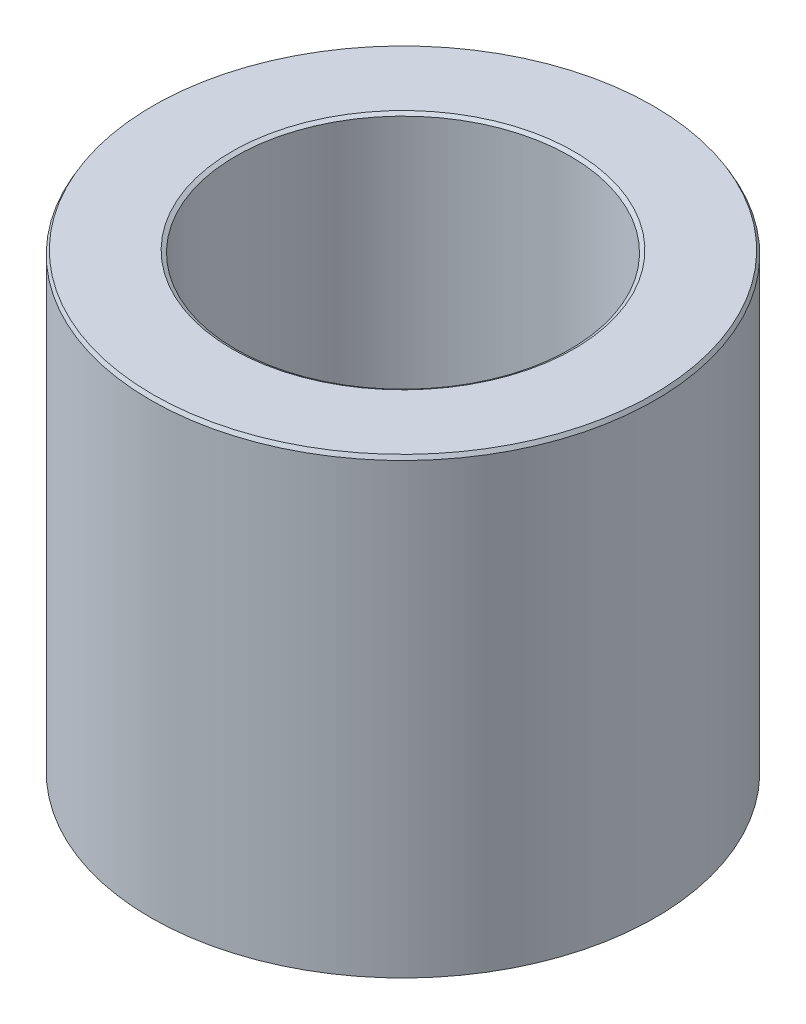
ISO-10303-21;
HEADER;
FILE_DESCRIPTION(('STEP AP214'),'2;1');
FILE_NAME('part.step','',(''),(''),'','','');
FILE_SCHEMA(('AUTOMOTIVE_DESIGN { 1 0 10303 214 1 1 1 1 }'));
ENDSEC;
DATA;
#1=APPLICATION_CONTEXT('core data for automotive mechanical design processes');
#2=APPLICATION_PROTOCOL_DEFINITION('international standard','automotive_design',2000,#1);
#3=PRODUCT_CONTEXT('',#1,'mechanical');
#4=PRODUCT('Part','Part','',(#3));
#5=PRODUCT_RELATED_PRODUCT_CATEGORY('part','',(#4));
#6=PRODUCT_DEFINITION_FORMATION('','',#4);
#7=PRODUCT_DEFINITION_CONTEXT('part definition',#1,'design');
#8=PRODUCT_DEFINITION('design','',#6,#7);
#9=PRODUCT_DEFINITION_SHAPE('','',#8);
#10=(LENGTH_UNIT() NAMED_UNIT(*) SI_UNIT(.MILLI.,.METRE.));
#11=(NAMED_UNIT(*) PLANE_ANGLE_UNIT() SI_UNIT($,.RADIAN.));
#12=(NAMED_UNIT(*) SI_UNIT($,.STERADIAN.) SOLID_ANGLE_UNIT());
#13=UNCERTAINTY_MEASURE_WITH_UNIT(LENGTH_MEASURE(1.E-05),#10,'distance_accuracy_value','');
#14=(GEOMETRIC_REPRESENTATION_CONTEXT(3) GLOBAL_UNCERTAINTY_ASSIGNED_CONTEXT((#13)) GLOBAL_UNIT_ASSIGNED_CONTEXT((#10,
#11,#12)) REPRESENTATION_CONTEXT('',''));
#15=CARTESIAN_POINT('',(0.,0.,0.));
#16=DIRECTION('',(0.,0.,1.));
#17=DIRECTION('',(1.,0.,0.));
#18=AXIS2_PLACEMENT_3D('',#15,#16,#17);
#19=CARTESIAN_POINT('',(0.,81.005665782409,0.));
#20=DIRECTION('',(0.,-1.,0.));
#21=DIRECTION('',(0.,0.,-1.));
#22=AXIS2_PLACEMENT_3D('',#19,#20,#21);
#23=CYLINDRICAL_SURFACE('',#22,45.);
#24=CARTESIAN_POINT('',(0.,0.389298457160334,0.));
#25=DIRECTION('',(0.,1.,0.));
#26=DIRECTION('',(0.,0.,1.));
#27=AXIS2_PLACEMENT_3D('',#24,#25,#26);
#28=CIRCLE('',#27,45.);
#29=CARTESIAN_POINT('',(0.,0.389298457160334,45.));
#30=VERTEX_POINT('',#29);
#31=EDGE_CURVE('E10',#30,#30,#28,.T.);
#32=ORIENTED_EDGE('',*,*,#31,.T.);
#33=EDGE_LOOP('',(#32));
#34=FACE_BOUND('',#33,.T.);
#35=CARTESIAN_POINT('',(0.,80.3313810752992,0.));
#36=DIRECTION('',(0.,1.,0.));
#37=DIRECTION('',(0.,0.,1.));
#38=AXIS2_PLACEMENT_3D('',#35,#36,#37);
#39=CIRCLE('',#38,45.);
#40=CARTESIAN_POINT('',(0.,80.3313810752992,45.));
#41=VERTEX_POINT('',#40);
#42=EDGE_CURVE('E50',#41,#41,#39,.F.);
#43=ORIENTED_EDGE('',*,*,#42,.T.);
#44=EDGE_LOOP('',(#43));
#45=FACE_BOUND('',#44,.T.);
#46=ADVANCED_FACE('F39',(#34,#45),#23,.T.);
#47=CARTESIAN_POINT('',(0.,81.005665782409,0.));
#48=DIRECTION('',(0.,1.,0.));
#49=DIRECTION('',(0.,0.,1.));
#50=AXIS2_PLACEMENT_3D('',#47,#48,#49);
#51=PLANE('',#50);
#52=CARTESIAN_POINT('',(0.,81.005665782409,0.));
#53=DIRECTION('',(0.,1.,0.));
#54=DIRECTION('',(0.,0.,1.));
#55=AXIS2_PLACEMENT_3D('',#52,#53,#54);
#56=CIRCLE('',#55,30.5108484996831);
#57=CARTESIAN_POINT('',(0.,81.005665782409,30.5108484996831));
#58=VERTEX_POINT('',#57);
#59=EDGE_CURVE('E58',#58,#58,#56,.F.);
#60=ORIENTED_EDGE('',*,*,#59,.T.);
#61=EDGE_LOOP('',(#60));
#62=FACE_BOUND('',#61,.T.);
#63=CARTESIAN_POINT('',(0.,81.005665782409,0.));
#64=DIRECTION('',(0.,1.,0.));
#65=DIRECTION('',(0.,0.,1.));
#66=AXIS2_PLACEMENT_3D('',#63,#64,#65);
#67=CIRCLE('',#66,44.6107015428397);
#68=CARTESIAN_POINT('',(0.,81.005665782409,44.6107015428397));
#69=VERTEX_POINT('',#68);
#70=EDGE_CURVE('E61',#69,#69,#67,.T.);
#71=ORIENTED_EDGE('',*,*,#70,.T.);
#72=EDGE_LOOP('',(#71));
#73=FACE_BOUND('',#72,.T.);
#74=ADVANCED_FACE('F88',(#62,#73),#51,.T.);
#75=CARTESIAN_POINT('',(0.,0.,0.));
#76=DIRECTION('',(0.,1.,0.));
#77=DIRECTION('',(0.,0.,1.));
#78=AXIS2_PLACEMENT_3D('',#75,#76,#77);
#79=PLANE('',#78);
#80=CARTESIAN_POINT('',(0.,0.,0.));
#81=DIRECTION('',(0.,1.,0.));
#82=DIRECTION('',(0.,0.,1.));
#83=AXIS2_PLACEMENT_3D('',#80,#81,#82);
#84=CIRCLE('',#83,30.2258622497336);
#85=CARTESIAN_POINT('',(0.,0.,30.2258622497336));
#86=VERTEX_POINT('',#85);
#87=EDGE_CURVE('E51',#86,#86,#84,.T.);
#88=ORIENTED_EDGE('',*,*,#87,.T.);
#89=EDGE_LOOP('',(#88));
#90=FACE_BOUND('',#89,.T.);
#91=CARTESIAN_POINT('',(0.,0.,0.));
#92=DIRECTION('',(0.,1.,0.));
#93=DIRECTION('',(0.,0.,1.));
#94=AXIS2_PLACEMENT_3D('',#91,#92,#93);
#95=CIRCLE('',#94,44.3257152928901);
#96=CARTESIAN_POINT('',(0.,0.,44.3257152928901));
#97=VERTEX_POINT('',#96);
#98=EDGE_CURVE('E54',#97,#97,#95,.F.);
#99=ORIENTED_EDGE('',*,*,#98,.T.);
#100=EDGE_LOOP('',(#99));
#101=FACE_BOUND('',#100,.T.);
#102=ADVANCED_FACE('F83',(#90,#101),#79,.F.);
#103=CARTESIAN_POINT('',(0.,81.005665782409,0.));
#104=DIRECTION('',(0.,-1.,0.));
#105=DIRECTION('',(0.,0.,-1.));
#106=AXIS2_PLACEMENT_3D('',#103,#104,#105);
#107=CYLINDRICAL_SURFACE('',#106,29.8365637925732);
#108=CARTESIAN_POINT('',(0.,80.6163673252487,0.));
#109=DIRECTION('',(0.,1.,0.));
#110=DIRECTION('',(0.,0.,1.));
#111=AXIS2_PLACEMENT_3D('',#108,#109,#110);
#112=CIRCLE('',#111,29.8365637925732);
#113=CARTESIAN_POINT('',(0.,80.6163673252487,29.8365637925732));
#114=VERTEX_POINT('',#113);
#115=EDGE_CURVE('E67',#114,#114,#112,.T.);
#116=ORIENTED_EDGE('',*,*,#115,.T.);
#117=EDGE_LOOP('',(#116));
#118=FACE_BOUND('',#117,.T.);
#119=CARTESIAN_POINT('',(0.,0.674284707109868,0.));
#120=DIRECTION('',(0.,1.,0.));
#121=DIRECTION('',(0.,0.,1.));
#122=AXIS2_PLACEMENT_3D('',#119,#120,#121);
#123=CIRCLE('',#122,29.8365637925732);
#124=CARTESIAN_POINT('',(0.,0.674284707109868,29.8365637925732));
#125=VERTEX_POINT('',#124);
#126=EDGE_CURVE('E69',#125,#125,#123,.F.);
#127=ORIENTED_EDGE('',*,*,#126,.T.);
#128=EDGE_LOOP('',(#127));
#129=FACE_BOUND('',#128,.T.);
#130=ADVANCED_FACE('F71',(#118,#129),#107,.F.);
#131=CARTESIAN_POINT('',(0.,80.6163673252487,0.));
#132=DIRECTION('',(0.,1.,0.));
#133=DIRECTION('',(0.,0.,1.));
#134=AXIS2_PLACEMENT_3D('',#131,#132,#133);
#135=CONICAL_SURFACE('',#134,29.8365637925732,1.04719755119661);
#136=ORIENTED_EDGE('',*,*,#59,.F.);
#137=EDGE_LOOP('',(#136));
#138=FACE_BOUND('',#137,.T.);
#139=ORIENTED_EDGE('',*,*,#115,.F.);
#140=EDGE_LOOP('',(#139));
#141=FACE_BOUND('',#140,.T.);
#142=ADVANCED_FACE('F77',(#138,#141),#135,.F.);
#143=CARTESIAN_POINT('',(0.,0.,0.));
#144=DIRECTION('',(0.,-1.,0.));
#145=DIRECTION('',(0.,0.,-1.));
#146=AXIS2_PLACEMENT_3D('',#143,#144,#145);
#147=CONICAL_SURFACE('',#146,30.2258622497336,0.523598775598291);
#148=ORIENTED_EDGE('',*,*,#126,.F.);
#149=EDGE_LOOP('',(#148));
#150=FACE_BOUND('',#149,.T.);
#151=ORIENTED_EDGE('',*,*,#87,.F.);
#152=EDGE_LOOP('',(#151));
#153=FACE_BOUND('',#152,.T.);
#154=ADVANCED_FACE('F73',(#150,#153),#147,.F.);
#155=CARTESIAN_POINT('',(0.,0.389298457160334,0.));
#156=DIRECTION('',(0.,1.,0.));
#157=DIRECTION('',(0.,0.,1.));
#158=AXIS2_PLACEMENT_3D('',#155,#156,#157);
#159=CONICAL_SURFACE('',#158,45.,1.04719755119661);
#160=ORIENTED_EDGE('',*,*,#98,.F.);
#161=EDGE_LOOP('',(#160));
#162=FACE_BOUND('',#161,.T.);
#163=ORIENTED_EDGE('',*,*,#31,.F.);
#164=EDGE_LOOP('',(#163));
#165=FACE_BOUND('',#164,.T.);
#166=ADVANCED_FACE('F76',(#162,#165),#159,.T.);
#167=CARTESIAN_POINT('',(0.,81.005665782409,0.));
#168=DIRECTION('',(0.,-1.,0.));
#169=DIRECTION('',(0.,0.,-1.));
#170=AXIS2_PLACEMENT_3D('',#167,#168,#169);
#171=CONICAL_SURFACE('',#170,44.6107015428397,0.523598775598306);
#172=ORIENTED_EDGE('',*,*,#42,.F.);
#173=EDGE_LOOP('',(#172));
#174=FACE_BOUND('',#173,.T.);
#175=ORIENTED_EDGE('',*,*,#70,.F.);
#176=EDGE_LOOP('',(#175));
#177=FACE_BOUND('',#176,.T.);
#178=ADVANCED_FACE('F45',(#174,#177),#171,.T.);
#179=CLOSED_SHELL('',(#46,#74,#102,#130,#142,#154,#166,#178));
#180=MANIFOLD_SOLID_BREP('B2',#179);
#181=ADVANCED_BREP_SHAPE_REPRESENTATION('',(#18,#180),#14);
#182=SHAPE_DEFINITION_REPRESENTATION(#9,#181);
ENDSEC;
END-ISO-10303-21;
